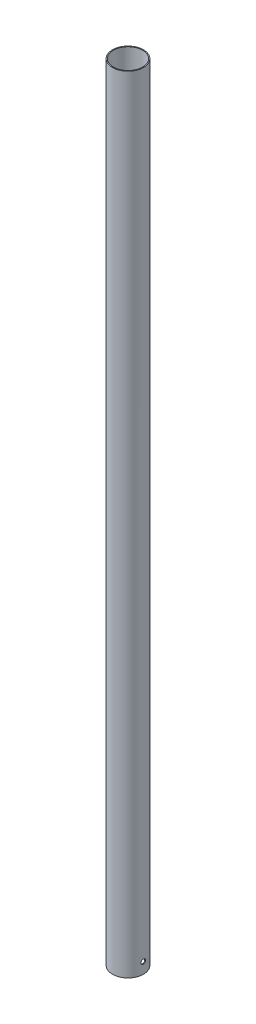
ISO-10303-21;
HEADER;
FILE_DESCRIPTION(('STEP AP214'),'2;1');
FILE_NAME('part.step','',(''),(''),'','','');
FILE_SCHEMA(('AUTOMOTIVE_DESIGN { 1 0 10303 214 1 1 1 1 }'));
ENDSEC;
DATA;
#1=APPLICATION_CONTEXT('core data for automotive mechanical design processes');
#2=APPLICATION_PROTOCOL_DEFINITION('international standard','automotive_design',2000,#1);
#3=PRODUCT_CONTEXT('',#1,'mechanical');
#4=PRODUCT('Part','Part','',(#3));
#5=PRODUCT_RELATED_PRODUCT_CATEGORY('part','',(#4));
#6=PRODUCT_DEFINITION_FORMATION('','',#4);
#7=PRODUCT_DEFINITION_CONTEXT('part definition',#1,'design');
#8=PRODUCT_DEFINITION('design','',#6,#7);
#9=PRODUCT_DEFINITION_SHAPE('','',#8);
#10=(LENGTH_UNIT() NAMED_UNIT(*) SI_UNIT(.MILLI.,.METRE.));
#11=(NAMED_UNIT(*) PLANE_ANGLE_UNIT() SI_UNIT($,.RADIAN.));
#12=(NAMED_UNIT(*) SI_UNIT($,.STERADIAN.) SOLID_ANGLE_UNIT());
#13=UNCERTAINTY_MEASURE_WITH_UNIT(LENGTH_MEASURE(1.E-05),#10,'distance_accuracy_value','');
#14=(GEOMETRIC_REPRESENTATION_CONTEXT(3) GLOBAL_UNCERTAINTY_ASSIGNED_CONTEXT((#13)) GLOBAL_UNIT_ASSIGNED_CONTEXT((#10,
#11,#12)) REPRESENTATION_CONTEXT('',''));
#15=CARTESIAN_POINT('',(0.,0.,0.));
#16=DIRECTION('',(0.,0.,1.));
#17=DIRECTION('',(1.,0.,0.));
#18=AXIS2_PLACEMENT_3D('',#15,#16,#17);
#19=CARTESIAN_POINT('',(0.,3588.,0.));
#20=DIRECTION('',(0.,-1.,0.));
#21=DIRECTION('',(0.,0.,-1.));
#22=AXIS2_PLACEMENT_3D('',#19,#20,#21);
#23=CYLINDRICAL_SURFACE('',#22,70.65);
#24=CARTESIAN_POINT('',(0.,3588.,0.));
#25=DIRECTION('',(0.,1.,0.));
#26=DIRECTION('',(0.,0.,1.));
#27=AXIS2_PLACEMENT_3D('',#24,#25,#26);
#28=CIRCLE('',#27,70.65);
#29=CARTESIAN_POINT('',(0.,3588.,70.65));
#30=VERTEX_POINT('',#29);
#31=EDGE_CURVE('E10',#30,#30,#28,.T.);
#32=ORIENTED_EDGE('',*,*,#31,.F.);
#33=EDGE_LOOP('',(#32));
#34=FACE_BOUND('',#33,.T.);
#35=CARTESIAN_POINT('',(0.,0.,0.));
#36=DIRECTION('',(0.,1.,0.));
#37=DIRECTION('',(0.,0.,1.));
#38=AXIS2_PLACEMENT_3D('',#35,#36,#37);
#39=CIRCLE('',#38,70.65);
#40=CARTESIAN_POINT('',(0.,0.,70.65));
#41=VERTEX_POINT('',#40);
#42=EDGE_CURVE('E35',#41,#41,#39,.T.);
#43=ORIENTED_EDGE('',*,*,#42,.T.);
#44=EDGE_LOOP('',(#43));
#45=FACE_BOUND('',#44,.T.);
#46=CARTESIAN_POINT('',(69.8653884266022,50.,10.5));
#47=CARTESIAN_POINT('',(69.8653868077956,50.2932439508898,10.5000039626959));
#48=CARTESIAN_POINT('',(69.8672383210719,50.5864322616091,10.4877113271215));
#49=CARTESIAN_POINT('',(69.8745874080696,51.1707979675925,10.4386390930965));
#50=CARTESIAN_POINT('',(69.8800857531186,51.4619749242758,10.4018543143992));
#51=CARTESIAN_POINT('',(69.8945776323533,52.040384942187,10.304025900023));
#52=CARTESIAN_POINT('',(69.9035741646534,52.3276144010046,10.242961454489));
#53=CARTESIAN_POINT('',(69.9248012059064,52.8958479324387,10.0970346431254));
#54=CARTESIAN_POINT('',(69.9370317848458,53.176851870189,10.012171762283));
#55=CARTESIAN_POINT('',(69.9643638640576,53.73042722795,9.81935605354532));
#56=CARTESIAN_POINT('',(69.9794630917751,54.0030051256896,9.71142149471269));
#57=CARTESIAN_POINT('',(70.0121077588097,54.5380667749752,9.47321013551929));
#58=CARTESIAN_POINT('',(70.0296532277259,54.800550404333,9.3429330648129));
#59=CARTESIAN_POINT('',(70.066690171728,55.3135701134425,9.06099494400925));
#60=CARTESIAN_POINT('',(70.0861813376226,55.5641080821617,8.90933728993168));
#61=CARTESIAN_POINT('',(70.126564090755,56.0515701396148,8.58569113097046));
#62=CARTESIAN_POINT('',(70.1474556894958,56.288494116495,8.41370245908083));
#63=CARTESIAN_POINT('',(70.1902055786862,56.7487284772624,8.04931158024618));
#64=CARTESIAN_POINT('',(70.2120696334732,56.9719314240115,7.85677433987815));
#65=CARTESIAN_POINT('',(70.2560100192535,57.4013563461544,7.45363384135625));
#66=CARTESIAN_POINT('',(70.2780863513406,57.6075782339958,7.2430304900672));
#67=CARTESIAN_POINT('',(70.3218327204705,58.0016255499886,6.8051991930761));
#68=CARTESIAN_POINT('',(70.3435027306194,58.1894497638745,6.57797015178813));
#69=CARTESIAN_POINT('',(70.3858267509878,58.5453695161554,6.10847236236011));
#70=CARTESIAN_POINT('',(70.4064807849341,58.7134655154036,5.86620396574316));
#71=CARTESIAN_POINT('',(70.4462882946095,59.0294924688663,5.36711450678431));
#72=CARTESIAN_POINT('',(70.4654341930885,59.1773240569005,5.11022990396718));
#73=CARTESIAN_POINT('',(70.5015729495803,59.4508026004135,4.58476350701888));
#74=CARTESIAN_POINT('',(70.5185657986447,59.5764494636908,4.31618166427883));
#75=CARTESIAN_POINT('',(70.5499142495427,59.8046254040933,3.76923341287514));
#76=CARTESIAN_POINT('',(70.5642699575843,59.9071554122625,3.49086739879653));
#77=CARTESIAN_POINT('',(70.5899349079998,60.0883328597191,2.92633204995656));
#78=CARTESIAN_POINT('',(70.6012441746094,60.1669804890003,2.64016277729299));
#79=CARTESIAN_POINT('',(70.6204213257038,60.2993041483902,2.06421793724995));
#80=CARTESIAN_POINT('',(70.6283139563104,60.3531599285273,1.7744844859255));
#81=CARTESIAN_POINT('',(70.6405547827793,60.4363392194099,1.1914428864036));
#82=CARTESIAN_POINT('',(70.6449029942788,60.465662838385,0.898134753982542));
#83=CARTESIAN_POINT('',(70.6499314141251,60.4995519350371,0.310074459882856));
#84=CARTESIAN_POINT('',(70.6506117992507,60.5041186059284,0.0153223684843043));
#85=CARTESIAN_POINT('',(70.6482856825474,60.4884617397955,-0.5735073094622));
#86=CARTESIAN_POINT('',(70.6452791963514,60.468238307885,-0.867584898864843));
#87=CARTESIAN_POINT('',(70.6357028669341,60.403414547276,-1.45062830723286));
#88=CARTESIAN_POINT('',(70.6291613416513,60.3590079199348,-1.73961615318771));
#89=CARTESIAN_POINT('',(70.6127163130375,60.246282745864,-2.31279011691312));
#90=CARTESIAN_POINT('',(70.602812830295,60.1779643455681,-2.5969762640777));
#91=CARTESIAN_POINT('',(70.5799192860665,60.0179225574663,-3.15855604841208));
#92=CARTESIAN_POINT('',(70.5669291713864,59.9261987662958,-3.43594956842857));
#93=CARTESIAN_POINT('',(70.538222684041,59.7200191939862,-3.98200971004599));
#94=CARTESIAN_POINT('',(70.5225062960156,59.6055632847712,-4.25067628246815));
#95=CARTESIAN_POINT('',(70.4887189247937,59.3542794999805,-4.77840798728216));
#96=CARTESIAN_POINT('',(70.4706394218891,59.2173701951567,-5.03743379788062));
#97=CARTESIAN_POINT('',(70.4326729917789,58.9224602655523,-5.5430459103717));
#98=CARTESIAN_POINT('',(70.4127860618048,58.7644596084675,-5.78963219321064));
#99=CARTESIAN_POINT('',(70.3717540951022,58.4284676314029,-6.26869492645658));
#100=CARTESIAN_POINT('',(70.3506089898059,58.2504752214481,-6.50117060647057));
#101=CARTESIAN_POINT('',(70.3076463299507,57.8757391386993,-6.95041704743086));
#102=CARTESIAN_POINT('',(70.2858287709031,57.6789953407169,-7.16718770350993));
#103=CARTESIAN_POINT('',(70.2419136566546,57.2661174201934,-7.58556161733868));
#104=CARTESIAN_POINT('',(70.2198154332787,57.0498142727342,-7.78699803848535));
#105=CARTESIAN_POINT('',(70.1761739862606,56.6009675763107,-8.17095154502307));
#106=CARTESIAN_POINT('',(70.1546307664002,56.3684239167235,-8.35346850152233));
#107=CARTESIAN_POINT('',(70.1127112743725,55.8887063720788,-8.69829847681125));
#108=CARTESIAN_POINT('',(70.0923350134992,55.6415323454721,-8.86061130007806));
#109=CARTESIAN_POINT('',(70.0533321804341,55.1342754308124,-9.16387112712552));
#110=CARTESIAN_POINT('',(70.0347056037548,54.8741925758695,-9.30481818570392));
#111=CARTESIAN_POINT('',(69.9997249373533,54.3427340808488,-9.56442300344919));
#112=CARTESIAN_POINT('',(69.9833725997311,54.0713499409921,-9.68306360195102));
#113=CARTESIAN_POINT('',(69.9534324832596,53.5193955318163,-9.89704322020492));
#114=CARTESIAN_POINT('',(69.939844708857,53.2388252477225,-9.99238220247746));
#115=CARTESIAN_POINT('',(69.9158322560455,52.6705215277148,-10.1590351344735));
#116=CARTESIAN_POINT('',(69.9054073986575,52.3827884981145,-10.2303504436431));
#117=CARTESIAN_POINT('',(69.8880270838446,51.8022233789266,-10.3484171479562));
#118=CARTESIAN_POINT('',(69.8810715967544,51.509391332961,-10.3951687531348));
#119=CARTESIAN_POINT('',(69.8708846063526,50.9235637504533,-10.4634203049617));
#120=CARTESIAN_POINT('',(69.8676182766578,50.6305963169164,-10.4851564403739));
#121=CARTESIAN_POINT('',(69.8647862768676,50.0438533162234,-10.504010234184));
#122=CARTESIAN_POINT('',(69.8652205834234,49.7500777541779,-10.5011280479088));
#123=CARTESIAN_POINT('',(69.8697771027464,49.1638382924398,-10.4707679475952));
#124=CARTESIAN_POINT('',(69.8738992087805,48.8713743550321,-10.4432907453913));
#125=CARTESIAN_POINT('',(69.8857110727229,48.2898466759379,-10.363951598682));
#126=CARTESIAN_POINT('',(69.8934008274483,48.000782931218,-10.3120896759322));
#127=CARTESIAN_POINT('',(69.9120785516072,47.4295271118311,-10.1846889920712));
#128=CARTESIAN_POINT('',(69.923050107419,47.1473082254249,-10.1092679782885));
#129=CARTESIAN_POINT('',(69.9479909195116,46.590254712591,-9.93522957202909));
#130=CARTESIAN_POINT('',(69.9619601627301,46.3154200539925,-9.83661228062961));
#131=CARTESIAN_POINT('',(69.9925001161996,45.7750318215374,-9.61689764604026));
#132=CARTESIAN_POINT('',(70.0090708928266,45.5094784846972,-9.49579972926177));
#133=CARTESIAN_POINT('',(70.0443471257812,44.9894742740669,-9.23198981782507));
#134=CARTESIAN_POINT('',(70.0630526491988,44.7350237495598,-9.08927714381935));
#135=CARTESIAN_POINT('',(70.1022189811833,44.237130826133,-8.7821142379209));
#136=CARTESIAN_POINT('',(70.1226917300971,43.9937835768604,-8.6175112875572));
#137=CARTESIAN_POINT('',(70.1646951611419,43.5217892928642,-8.26855039742001));
#138=CARTESIAN_POINT('',(70.1862258478095,43.2931423211888,-8.08419237292801));
#139=CARTESIAN_POINT('',(70.2297429988655,42.8521001219638,-7.69698923813225));
#140=CARTESIAN_POINT('',(70.2517294907204,42.6397058774325,-7.49414301122459));
#141=CARTESIAN_POINT('',(70.2955427949651,42.2326456953528,-7.07137287605494));
#142=CARTESIAN_POINT('',(70.3173696103329,42.0379794263985,-6.85144928717877));
#143=CARTESIAN_POINT('',(70.3604320855007,41.6661961871102,-6.39415803453531));
#144=CARTESIAN_POINT('',(70.3816614341905,41.4892361229515,-6.15666217535102));
#145=CARTESIAN_POINT('',(70.4227398463575,41.1559541698472,-5.66749022669614));
#146=CARTESIAN_POINT('',(70.4425889011978,40.9996324100352,-5.41581404851358));
#147=CARTESIAN_POINT('',(70.4803439747844,40.7087572109394,-4.90004702762652));
#148=CARTESIAN_POINT('',(70.4982500294794,40.5742033688903,-4.63595641473929));
#149=CARTESIAN_POINT('',(70.5316108236673,40.3278477292655,-4.09721870903808));
#150=CARTESIAN_POINT('',(70.5470655775195,40.2160457984103,-3.8225716780743));
#151=CARTESIAN_POINT('',(70.5750324197792,40.0163912957741,-3.2656903041152));
#152=CARTESIAN_POINT('',(70.58755500836,39.9284530816428,-2.98348719635895));
#153=CARTESIAN_POINT('',(70.6093738976419,39.7766526716166,-2.41255464128633));
#154=CARTESIAN_POINT('',(70.6186702031722,39.7127904396834,-2.1238252037396));
#155=CARTESIAN_POINT('',(70.6337711766946,39.6096324355602,-1.5419358700558));
#156=CARTESIAN_POINT('',(70.6395760344149,39.570335328476,-1.24877621554809));
#157=CARTESIAN_POINT('',(70.6475289845613,39.5166054825114,-0.660138491001243));
#158=CARTESIAN_POINT('',(70.6496771028478,39.5021725677924,-0.364660437372586));
#159=CARTESIAN_POINT('',(70.6502525264476,39.4983009306492,0.22361153200235));
#160=CARTESIAN_POINT('',(70.6487155006485,39.5086226063006,0.516403864283397));
#161=CARTESIAN_POINT('',(70.6420380655269,39.553683077044,1.10006039523698));
#162=CARTESIAN_POINT('',(70.6368976809919,39.5884217041717,1.39092460715917));
#163=CARTESIAN_POINT('',(70.6231576735045,39.6820525236096,1.96865293458877));
#164=CARTESIAN_POINT('',(70.6145580731873,39.7409445578736,2.25551707625766));
#165=CARTESIAN_POINT('',(70.5941401054888,39.8824403818106,2.82321885738941));
#166=CARTESIAN_POINT('',(70.5823217298451,39.9650442323491,3.1040564813809));
#167=CARTESIAN_POINT('',(70.5558051466218,40.1532843536874,3.65753666148297));
#168=CARTESIAN_POINT('',(70.5411090064238,40.2589040960157,3.93018493957605));
#169=CARTESIAN_POINT('',(70.5092390917966,40.4924414411683,4.46560575404623));
#170=CARTESIAN_POINT('',(70.492065320941,40.6203590118318,4.72837830466671));
#171=CARTESIAN_POINT('',(70.4557183401323,40.8975491465402,5.24219244936003));
#172=CARTESIAN_POINT('',(70.436545533964,41.0468174002213,5.49323639771306));
#173=CARTESIAN_POINT('',(70.3967168077883,41.3657501033865,5.9820508842366));
#174=CARTESIAN_POINT('',(70.3760602241082,41.5354237030608,6.21981539711785));
#175=CARTESIAN_POINT('',(70.3336459501417,41.8955867650156,6.68245545165204));
#176=CARTESIAN_POINT('',(70.3118798883895,42.0862531183408,6.9071925378498));
#177=CARTESIAN_POINT('',(70.26804337252,42.4856937297401,7.33974313112421));
#178=CARTESIAN_POINT('',(70.2459730500361,42.6944603517461,7.54756370381724));
#179=CARTESIAN_POINT('',(70.2021283342876,43.1288269671279,7.94504155074765));
#180=CARTESIAN_POINT('',(70.1803540795024,43.3544345376195,8.13469056049514));
#181=CARTESIAN_POINT('',(70.1377258108324,43.8208415234673,8.49439407729127));
#182=CARTESIAN_POINT('',(70.1168717862778,44.0616407626007,8.66444881156819));
#183=CARTESIAN_POINT('',(70.0765633231744,44.5581461690661,8.98465182125736));
#184=CARTESIAN_POINT('',(70.0571172782493,44.813927529319,9.13468459732241));
#185=CARTESIAN_POINT('',(70.0203143966526,45.3373738450066,9.41263691767094));
#186=CARTESIAN_POINT('',(70.0029575292949,45.6050386258165,9.54055678676447));
#187=CARTESIAN_POINT('',(69.9708520648531,46.1501222355337,9.77323692857143));
#188=CARTESIAN_POINT('',(69.9561010927739,46.4275319036244,9.87801831155085));
#189=CARTESIAN_POINT('',(69.9296219096159,46.9902572313866,10.0637594456414));
#190=CARTESIAN_POINT('',(69.9178930188594,47.2755710973585,10.1447245537057));
#191=CARTESIAN_POINT('',(69.8939673343612,47.9622630707961,10.3085027401896));
#192=CARTESIAN_POINT('',(69.8832994701823,48.3663898458444,10.3802342520631));
#193=CARTESIAN_POINT('',(69.8690111916866,49.1803806746395,10.4759798128389));
#194=CARTESIAN_POINT('',(69.8653906885915,49.590244656047,10.4999944628497));
#195=CARTESIAN_POINT('',(69.8653884266022,50.,10.5));
#196=B_SPLINE_CURVE_WITH_KNOTS('',3,(#46,#47,#48,#49,#50,#51,#52,#53,#54,#55,#56,#57,#58,#59,
#60,#61,#62,#63,#64,#65,#66,#67,#68,#69,#70,#71,#72,#73,#74,#75,#76,#77,#78,#79,#80,#81,#82,#83,
#84,#85,#86,#87,#88,#89,#90,#91,#92,#93,#94,#95,#96,#97,#98,#99,#100,#101,#102,#103,#104,#105,
#106,#107,#108,#109,#110,#111,#112,#113,#114,#115,#116,#117,#118,#119,#120,#121,#122,#123,#124,
#125,#126,#127,#128,#129,#130,#131,#132,#133,#134,#135,#136,#137,#138,#139,#140,#141,#142,#143,
#144,#145,#146,#147,#148,#149,#150,#151,#152,#153,#154,#155,#156,#157,#158,#159,#160,#161,#162,
#163,#164,#165,#166,#167,#168,#169,#170,#171,#172,#173,#174,#175,#176,#177,#178,#179,#180,#181,
#182,#183,#184,#185,#186,#187,#188,#189,#190,#191,#192,#193,#194,#195),.UNSPECIFIED.,.T.,.F.,(4,
2,2,2,2,2,2,2,2,2,2,2,2,2,2,2,2,2,2,2,2,2,2,2,2,2,2,2,2,2,2,2,2,2,2,2,2,2,2,2,2,2,2,2,2,2,2,2,2,
2,2,2,2,2,2,2,2,2,2,2,2,2,2,2,2,2,2,2,2,2,2,2,2,2,4),(0.,0.879372845288269,1.7589317427325,
2.63924613182132,3.51957957292258,4.39921849668794,5.27886806488317,6.15837806959949,
7.03789529941568,7.92359681132245,8.80930288950944,9.69506738587756,10.5808111865752,
11.4707537040756,12.3606999201609,13.2506102867653,14.1405135735878,15.0238589743542,
15.9072004780019,16.7904994067248,17.6737945901438,18.5501166870823,19.4264334175933,
20.3027652514205,21.1791020227654,22.0586901922766,22.9382797090156,23.8179172053642,
24.6975605747788,25.5857054551018,26.4738563856523,27.3620159104991,28.2501731574045,
29.1390109048327,30.0278500819047,30.916638953099,31.8054202244663,32.6857392003039,
33.5660526218603,34.4463405660137,35.3266277247929,36.2025838018421,37.0785360620062,
37.954510674988,38.8305128253922,39.7129829085221,40.5954567762258,41.4779839767262,
42.3604946759178,43.2502382426293,44.1399873761887,45.0297200451048,45.9194475018595,
46.8059383498896,47.6924278709695,48.57886921511,49.4653042903468,50.3431941617397,
51.2210779941846,52.098956082348,52.9768364239432,53.8540883961845,54.7313391031505,
55.6084129564419,56.4858815851145,57.3714103446127,58.2565673218992,59.1421249795781,
60.0276723667058,60.9181256178083,61.8085657881906,62.6981901830205,63.5876143229098,
64.816394186465,66.0451585704896),.UNSPECIFIED.);
#197=CARTESIAN_POINT('',(69.8653884266022,50.,10.5));
#198=VERTEX_POINT('',#197);
#199=EDGE_CURVE('E50',#198,#198,#196,.T.);
#200=ORIENTED_EDGE('',*,*,#199,.T.);
#201=EDGE_LOOP('',(#200));
#202=FACE_BOUND('',#201,.T.);
#203=ADVANCED_FACE('F32',(#34,#45,#202),#23,.T.);
#204=CARTESIAN_POINT('',(0.,3588.,0.));
#205=DIRECTION('',(0.,-1.,0.));
#206=DIRECTION('',(0.,0.,-1.));
#207=AXIS2_PLACEMENT_3D('',#204,#205,#206);
#208=CYLINDRICAL_SURFACE('',#207,66.69);
#209=CARTESIAN_POINT('',(0.,0.,0.));
#210=DIRECTION('',(0.,1.,0.));
#211=DIRECTION('',(0.,0.,1.));
#212=AXIS2_PLACEMENT_3D('',#209,#210,#211);
#213=CIRCLE('',#212,66.69);
#214=CARTESIAN_POINT('',(0.,0.,66.69));
#215=VERTEX_POINT('',#214);
#216=EDGE_CURVE('E44',#215,#215,#213,.T.);
#217=ORIENTED_EDGE('',*,*,#216,.F.);
#218=EDGE_LOOP('',(#217));
#219=FACE_BOUND('',#218,.T.);
#220=CARTESIAN_POINT('',(0.,3588.,0.));
#221=DIRECTION('',(0.,1.,0.));
#222=DIRECTION('',(0.,0.,1.));
#223=AXIS2_PLACEMENT_3D('',#220,#221,#222);
#224=CIRCLE('',#223,66.69);
#225=CARTESIAN_POINT('',(0.,3588.,66.69));
#226=VERTEX_POINT('',#225);
#227=EDGE_CURVE('E42',#226,#226,#224,.T.);
#228=ORIENTED_EDGE('',*,*,#227,.T.);
#229=EDGE_LOOP('',(#228));
#230=FACE_BOUND('',#229,.T.);
#231=CARTESIAN_POINT('',(65.8582272764763,50.,10.5));
#232=CARTESIAN_POINT('',(65.8582254518199,50.2930283477437,10.5000042223557));
#233=CARTESIAN_POINT('',(65.8601868097875,50.5859984751915,10.4877295176605));
#234=CARTESIAN_POINT('',(65.8679714235622,51.1699262139506,10.4387304905113));
#235=CARTESIAN_POINT('',(65.8737954717838,51.4608833999379,10.4020011512872));
#236=CARTESIAN_POINT('',(65.8891450628474,52.0388449384347,10.3043240089796));
#237=CARTESIAN_POINT('',(65.8986736878418,52.3258457929178,10.2433560387623));
#238=CARTESIAN_POINT('',(65.9211550879539,52.8936233811088,10.0976651141013));
#239=CARTESIAN_POINT('',(65.9341079389804,53.1743999766867,10.012941633039));
#240=CARTESIAN_POINT('',(65.9630521658937,53.7275159719729,9.82045334340441));
#241=CARTESIAN_POINT('',(65.9790410260955,53.9998621414878,9.71270760224277));
#242=CARTESIAN_POINT('',(66.0136075175552,54.5344726050366,9.47492201775696));
#243=CARTESIAN_POINT('',(66.0321851789651,54.7967367815987,9.34488191476351));
#244=CARTESIAN_POINT('',(66.0714000069353,55.3093415339004,9.0634635047113));
#245=CARTESIAN_POINT('',(66.0920368702638,55.5596838572186,8.91208833803873));
#246=CARTESIAN_POINT('',(66.1347929394573,56.0467850941021,8.58905101007403));
#247=CARTESIAN_POINT('',(66.1569121589692,56.2835438825767,8.41738866200195));
#248=CARTESIAN_POINT('',(66.2021941147494,56.7436821070213,8.05353688287419));
#249=CARTESIAN_POINT('',(66.2253637019447,56.9669413754939,7.86119631934286));
#250=CARTESIAN_POINT('',(66.2719299432858,57.3964991353893,7.45845043540749));
#251=CARTESIAN_POINT('',(66.2953265987149,57.6027975308824,7.24804501284344));
#252=CARTESIAN_POINT('',(66.3416923309932,57.9970226713694,6.81060391433789));
#253=CARTESIAN_POINT('',(66.3646613785563,58.1849481617591,6.58356710456195));
#254=CARTESIAN_POINT('',(66.4095265571029,58.5410968569047,6.11444132328535));
#255=CARTESIAN_POINT('',(66.4314227134279,58.7093205271438,5.87235270761182));
#256=CARTESIAN_POINT('',(66.473641907134,59.0257239501487,5.37345539326318));
#257=CARTESIAN_POINT('',(66.4939559265791,59.173791954811,5.11657503899699));
#258=CARTESIAN_POINT('',(66.5323041692981,59.4477406108955,4.59107786499226));
#259=CARTESIAN_POINT('',(66.5503383819176,59.5736211586288,4.32246099041263));
#260=CARTESIAN_POINT('',(66.5836129030693,59.8022552003168,3.77540387160546));
#261=CARTESIAN_POINT('',(66.5988533374695,59.9050097362133,3.49696407060369));
#262=CARTESIAN_POINT('',(66.6261056437527,60.0866209013304,2.93224306963232));
#263=CARTESIAN_POINT('',(66.6381175445214,60.1654777443637,2.64596193984407));
#264=CARTESIAN_POINT('',(66.6584838712305,60.2981375086449,2.07001693663804));
#265=CARTESIAN_POINT('',(66.6668676689968,60.3521418620489,1.78040049153291));
#266=CARTESIAN_POINT('',(66.6798836346902,60.435635394004,1.19757142786944));
#267=CARTESIAN_POINT('',(66.6845158211662,60.4651246937624,0.904358827098476));
#268=CARTESIAN_POINT('',(66.6898969046881,60.4993588430156,0.316472871536749));
#269=CARTESIAN_POINT('',(66.6906460103934,60.5041050220957,0.0217995960879007));
#270=CARTESIAN_POINT('',(66.6882401747039,60.4888194996843,-0.566886766048772));
#271=CARTESIAN_POINT('',(66.6850852519266,60.4687879163529,-0.860899855878187));
#272=CARTESIAN_POINT('',(66.6750060343534,60.4043898017906,-1.44354339762935));
#273=CARTESIAN_POINT('',(66.6681153713146,60.3602403697364,-1.73219845924366));
#274=CARTESIAN_POINT('',(66.6507791763801,60.2480890972366,-2.30472568925086));
#275=CARTESIAN_POINT('',(66.6403336689169,60.1800874207281,-2.58859789050241));
#276=CARTESIAN_POINT('',(66.6161775543393,60.020738883012,-3.14957400013086));
#277=CARTESIAN_POINT('',(66.6024668858548,59.9293915830108,-3.42667778118437));
#278=CARTESIAN_POINT('',(66.5721597120398,59.7240246464474,-3.97218905852089));
#279=CARTESIAN_POINT('',(66.5555631886047,59.6100048676476,-4.24059650023441));
#280=CARTESIAN_POINT('',(66.5198679332204,59.3596015713438,-4.76795682392175));
#281=CARTESIAN_POINT('',(66.5007591660201,59.2231277793922,-5.02686615824616));
#282=CARTESIAN_POINT('',(66.4606215199406,58.9291270093807,-5.53228371679007));
#283=CARTESIAN_POINT('',(66.4395926378198,58.7715999957782,-5.77879192007282));
#284=CARTESIAN_POINT('',(66.3961936698756,58.4365877029173,-6.25774728880868));
#285=CARTESIAN_POINT('',(66.3738235022438,58.2591012056994,-6.49019359485003));
#286=CARTESIAN_POINT('',(66.3283596527432,57.8854029394114,-6.9394372976401));
#287=CARTESIAN_POINT('',(66.3052659654317,57.6891910294544,-7.15623457662654));
#288=CARTESIAN_POINT('',(66.2587411039458,57.2771570517177,-7.57497158950235));
#289=CARTESIAN_POINT('',(66.2353089854604,57.0611454273367,-7.77672474368653));
#290=CARTESIAN_POINT('',(66.1890187218607,56.6128506504312,-8.16133759981065));
#291=CARTESIAN_POINT('',(66.1661605811283,56.380567373738,-8.34419715754764));
#292=CARTESIAN_POINT('',(66.1216674813483,55.9013320409507,-8.68973799459911));
#293=CARTESIAN_POINT('',(66.1000325363859,55.6543798160105,-8.85241904158359));
#294=CARTESIAN_POINT('',(66.0586050068096,55.1475217421643,-9.15643774410678));
#295=CARTESIAN_POINT('',(66.038812417014,54.8876159296945,-9.29777545967609));
#296=CARTESIAN_POINT('',(66.0016228706608,54.3564173348948,-9.55820102198686));
#297=CARTESIAN_POINT('',(65.984228165025,54.0851141611906,-9.67726799983274));
#298=CARTESIAN_POINT('',(65.9523630870566,53.5332656676756,-9.89210319045138));
#299=CARTESIAN_POINT('',(65.9378927201409,53.2527203307462,-9.98787136006682));
#300=CARTESIAN_POINT('',(65.912302421813,52.6844135714607,-10.1553766657035));
#301=CARTESIAN_POINT('',(65.9011822763255,52.396652611448,-10.2271153372155));
#302=CARTESIAN_POINT('',(65.8826205262651,51.8159809008985,-10.3460156566488));
#303=CARTESIAN_POINT('',(65.8751788861814,51.5230702001034,-10.3931775418243));
#304=CARTESIAN_POINT('',(65.8642541498031,50.9373822992594,-10.462185880584));
#305=CARTESIAN_POINT('',(65.8607296417221,50.6446370566943,-10.4842972170606));
#306=CARTESIAN_POINT('',(65.857600612247,50.05830311938,-10.5039346071994));
#307=CARTESIAN_POINT('',(65.8579960631206,49.7647144306126,-10.5014608347922));
#308=CARTESIAN_POINT('',(65.8626952786754,49.1788161847821,-10.4719478638298));
#309=CARTESIAN_POINT('',(65.8669989161401,48.8865065863942,-10.4449094648847));
#310=CARTESIAN_POINT('',(65.8793885113264,48.3052554989577,-10.3664768372033));
#311=CARTESIAN_POINT('',(65.8874744650793,48.0163140063754,-10.3150826340229));
#312=CARTESIAN_POINT('',(65.9071380095273,47.445461695194,-10.1886858703347));
#313=CARTESIAN_POINT('',(65.9186958381636,47.1635206134043,-10.1138168266839));
#314=CARTESIAN_POINT('',(65.9449878568437,46.606978795465,-9.94094127171015));
#315=CARTESIAN_POINT('',(65.9597220312197,46.3323780231156,-9.84293487451573));
#316=CARTESIAN_POINT('',(65.9919488187164,45.7924051761571,-9.62449845250466));
#317=CARTESIAN_POINT('',(66.0094415131108,45.527033373741,-9.50406776698576));
#318=CARTESIAN_POINT('',(66.0466929289604,45.0073317416952,-9.24164524245518));
#319=CARTESIAN_POINT('',(66.0664517243736,44.7530022728247,-9.09965269968614));
#320=CARTESIAN_POINT('',(66.1078535279809,44.2550655372459,-8.79384982191984));
#321=CARTESIAN_POINT('',(66.1295107434726,44.0115641096278,-8.6298690623231));
#322=CARTESIAN_POINT('',(66.1739575545888,43.5392060469179,-8.28215850106686));
#323=CARTESIAN_POINT('',(66.1967471556191,43.3103494817521,-8.09842860512059));
#324=CARTESIAN_POINT('',(66.2428225160249,42.8688251221527,-7.71247855958692));
#325=CARTESIAN_POINT('',(66.2661083083799,42.656158408105,-7.51025717799865));
#326=CARTESIAN_POINT('',(66.3125254593411,42.2484869519255,-7.08872457736879));
#327=CARTESIAN_POINT('',(66.3356568207651,42.0534818867107,-6.8694136710808));
#328=CARTESIAN_POINT('',(66.3813334512027,41.6807531462371,-6.4130897585049));
#329=CARTESIAN_POINT('',(66.4038713203719,41.5032059947886,-6.17593178183599));
#330=CARTESIAN_POINT('',(66.447498386486,41.168723339732,-5.68737159505513));
#331=CARTESIAN_POINT('',(66.46858757322,41.0117879813958,-5.43596928456704));
#332=CARTESIAN_POINT('',(66.508719523739,40.719665205842,-4.92068062504536));
#333=CARTESIAN_POINT('',(66.5277623287914,40.5844773500364,-4.65679452791476));
#334=CARTESIAN_POINT('',(66.5632610222024,40.3368409183998,-4.1183922727018));
#335=CARTESIAN_POINT('',(66.5797169274596,40.224392194027,-3.84387618407308));
#336=CARTESIAN_POINT('',(66.6095129727863,40.0234797808463,-3.28728360169214));
#337=CARTESIAN_POINT('',(66.6228653249352,39.9349218558193,-3.00524178208129));
#338=CARTESIAN_POINT('',(66.6461592908898,39.7818702604849,-2.43456317276631));
#339=CARTESIAN_POINT('',(66.6561009102312,39.7173765511206,-2.14592639376683));
#340=CARTESIAN_POINT('',(66.6722894349171,39.612953107906,-1.56415824084761));
#341=CARTESIAN_POINT('',(66.6785365666634,39.573021868838,-1.27102714347367));
#342=CARTESIAN_POINT('',(66.6871583443078,39.518028394598,-0.682385489296795));
#343=CARTESIAN_POINT('',(66.6895330211357,39.5029659607953,-0.386874951517728));
#344=CARTESIAN_POINT('',(66.6903377352012,39.4978549353865,0.201167797576085));
#345=CARTESIAN_POINT('',(66.6888101618737,39.5075375433667,0.493697650148059));
#346=CARTESIAN_POINT('',(66.6819425472159,39.5512762870505,1.07688243723618));
#347=CARTESIAN_POINT('',(66.6766025353063,39.5853322346632,1.36753738620364));
#348=CARTESIAN_POINT('',(66.6622595943233,39.6775572141977,1.9449006871727));
#349=CARTESIAN_POINT('',(66.653256694566,39.7357260531306,2.23160907074191));
#350=CARTESIAN_POINT('',(66.6318393181236,39.8757374836574,2.79905498962613));
#351=CARTESIAN_POINT('',(66.6194248318732,39.9575801416278,3.07979250819767));
#352=CARTESIAN_POINT('',(66.5915421990526,40.1442456372392,3.63308040378975));
#353=CARTESIAN_POINT('',(66.576076808684,40.24904774258,3.90563791647448));
#354=CARTESIAN_POINT('',(66.5425130281742,40.480909181354,4.44094460852106));
#355=CARTESIAN_POINT('',(66.5244146425246,40.6079684768185,4.70369380461402));
#356=CARTESIAN_POINT('',(66.4860870556386,40.8834075366127,5.21753787935663));
#357=CARTESIAN_POINT('',(66.4658582702737,41.0317831418762,5.46863501884674));
#358=CARTESIAN_POINT('',(66.4238127444678,41.3489018203377,5.95763898529757));
#359=CARTESIAN_POINT('',(66.4019952930628,41.5176540350435,6.1955398216639));
#360=CARTESIAN_POINT('',(66.3571492354099,41.8761405282843,6.65879601977736));
#361=CARTESIAN_POINT('',(66.3341104917636,42.0660724935514,6.88399744768575));
#362=CARTESIAN_POINT('',(66.2876852887539,42.4640756628026,7.31754063625975));
#363=CARTESIAN_POINT('',(66.2642989789467,42.6721392421418,7.52588941335276));
#364=CARTESIAN_POINT('',(66.217813747338,43.1051397662941,7.92448946915099));
#365=CARTESIAN_POINT('',(66.1947149600035,43.3300842839906,8.11473253768052));
#366=CARTESIAN_POINT('',(66.1494661577343,43.7952166623012,8.4756901295223));
#367=CARTESIAN_POINT('',(66.1273161323999,44.0354043557588,8.64640486692442));
#368=CARTESIAN_POINT('',(66.0844578558423,44.5309267975421,8.9681124432796));
#369=CARTESIAN_POINT('',(66.0637595177998,44.7863470928955,9.11897488316543));
#370=CARTESIAN_POINT('',(66.0245570280892,45.3091605975722,9.39861221910851));
#371=CARTESIAN_POINT('',(66.0060528433252,45.5765536262191,9.52738744833469));
#372=CARTESIAN_POINT('',(65.9717930516454,46.1211932338945,9.76179586511975));
#373=CARTESIAN_POINT('',(65.9560349937802,46.3984307577576,9.86744971054457));
#374=CARTESIAN_POINT('',(65.9277122934361,46.9609067386199,10.0549397420467));
#375=CARTESIAN_POINT('',(65.9151469478657,47.2461434186741,10.1367811726149));
#376=CARTESIAN_POINT('',(65.8892900374967,47.9374100193771,10.303759058913));
#377=CARTESIAN_POINT('',(65.8776965579288,48.3463705796612,10.377264799325));
#378=CARTESIAN_POINT('',(65.8621665266892,49.1702597099056,10.4753819123413));
#379=CARTESIAN_POINT('',(65.8582298594652,49.5851881897062,10.4999940228205));
#380=CARTESIAN_POINT('',(65.8582272764763,50.,10.5));
#381=B_SPLINE_CURVE_WITH_KNOTS('',3,(#231,#232,#233,#234,#235,#236,#237,#238,#239,#240,#241,
#242,#243,#244,#245,#246,#247,#248,#249,#250,#251,#252,#253,#254,#255,#256,#257,#258,#259,#260,
#261,#262,#263,#264,#265,#266,#267,#268,#269,#270,#271,#272,#273,#274,#275,#276,#277,#278,#279,
#280,#281,#282,#283,#284,#285,#286,#287,#288,#289,#290,#291,#292,#293,#294,#295,#296,#297,#298,
#299,#300,#301,#302,#303,#304,#305,#306,#307,#308,#309,#310,#311,#312,#313,#314,#315,#316,#317,
#318,#319,#320,#321,#322,#323,#324,#325,#326,#327,#328,#329,#330,#331,#332,#333,#334,#335,#336,
#337,#338,#339,#340,#341,#342,#343,#344,#345,#346,#347,#348,#349,#350,#351,#352,#353,#354,#355,
#356,#357,#358,#359,#360,#361,#362,#363,#364,#365,#366,#367,#368,#369,#370,#371,#372,#373,#374,
#375,#376,#377,#378,#379,#380),.UNSPECIFIED.,.T.,.F.,(4,2,2,2,2,2,2,2,2,2,2,2,2,2,2,2,2,2,2,2,2,
2,2,2,2,2,2,2,2,2,2,2,2,2,2,2,2,2,2,2,2,2,2,2,2,2,2,2,2,2,2,2,2,2,2,2,2,2,2,2,2,2,2,2,2,2,2,2,2,
2,2,2,2,2,4),(0.,0.878721440473774,1.75762320268936,2.63725776822698,3.51691183528231,
4.3958401630443,5.27477872865037,6.15358805491982,7.03240547283841,7.91814986227681,
8.80389926108787,9.68970910160974,10.5754980093995,11.4660136467976,12.3565334457422,
13.2470131143084,14.1374848155197,15.020606207704,15.9037232335351,16.7867928040924,
17.6698581634889,18.5451024584772,19.4203407380084,20.2955954693276,21.1708556918029,
22.0497248977454,22.9285955874284,23.8075199363229,24.6864508986213,25.5749116755561,
26.4633792330528,27.351857019179,28.2403323063115,29.1296360173972,30.0189413757633,
30.9081898964573,31.7974298325548,32.677176582798,33.5569171091593,34.4366289998639,
35.3163399675099,36.1911355273766,37.0659267722743,37.9407437958287,38.8155893786711,
39.69765657864,40.5797279899816,41.461858212479,42.3439722949937,43.2342453344863,
44.124524648283,45.014786005313,45.9050415465854,46.7917323921961,47.6784217986714,
48.5650568623344,49.4516848442827,50.3287225987106,51.2057535850472,52.0827775521511,
52.9598039782793,53.8360416932193,54.7122779133967,55.5883434010412,56.4648033863074,
57.3502646017089,58.2353552463366,59.120845348825,60.006325742719,60.8973593733676,
61.7883795622628,62.6786003867222,63.5686249986068,64.8125644853035,66.0564851990281),.UNSPECIFIED.);
#382=CARTESIAN_POINT('',(65.8582272764763,50.,10.5));
#383=VERTEX_POINT('',#382);
#384=EDGE_CURVE('E47',#383,#383,#381,.T.);
#385=ORIENTED_EDGE('',*,*,#384,.F.);
#386=EDGE_LOOP('',(#385));
#387=FACE_BOUND('',#386,.T.);
#388=ADVANCED_FACE('F70',(#219,#230,#387),#208,.F.);
#389=CARTESIAN_POINT('',(0.,3588.,0.));
#390=DIRECTION('',(0.,1.,0.));
#391=DIRECTION('',(0.,0.,1.));
#392=AXIS2_PLACEMENT_3D('',#389,#390,#391);
#393=PLANE('',#392);
#394=ORIENTED_EDGE('',*,*,#31,.T.);
#395=EDGE_LOOP('',(#394));
#396=FACE_BOUND('',#395,.T.);
#397=ORIENTED_EDGE('',*,*,#227,.F.);
#398=EDGE_LOOP('',(#397));
#399=FACE_BOUND('',#398,.T.);
#400=ADVANCED_FACE('F74',(#396,#399),#393,.T.);
#401=CARTESIAN_POINT('',(0.,0.,0.));
#402=DIRECTION('',(0.,1.,0.));
#403=DIRECTION('',(0.,0.,1.));
#404=AXIS2_PLACEMENT_3D('',#401,#402,#403);
#405=PLANE('',#404);
#406=ORIENTED_EDGE('',*,*,#42,.F.);
#407=EDGE_LOOP('',(#406));
#408=FACE_BOUND('',#407,.T.);
#409=ORIENTED_EDGE('',*,*,#216,.T.);
#410=EDGE_LOOP('',(#409));
#411=FACE_BOUND('',#410,.T.);
#412=ADVANCED_FACE('F68',(#408,#411),#405,.F.);
#413=CARTESIAN_POINT('',(70.651,50.,0.));
#414=DIRECTION('',(-1.,0.,0.));
#415=DIRECTION('',(0.,0.,1.));
#416=AXIS2_PLACEMENT_3D('',#413,#414,#415);
#417=CYLINDRICAL_SURFACE('',#416,10.5);
#418=ORIENTED_EDGE('',*,*,#384,.T.);
#419=EDGE_LOOP('',(#418));
#420=FACE_BOUND('',#419,.T.);
#421=ORIENTED_EDGE('',*,*,#199,.F.);
#422=EDGE_LOOP('',(#421));
#423=FACE_BOUND('',#422,.T.);
#424=ADVANCED_FACE('F62',(#420,#423),#417,.F.);
#425=CLOSED_SHELL('',(#203,#388,#400,#412,#424));
#426=MANIFOLD_SOLID_BREP('B2',#425);
#427=ADVANCED_BREP_SHAPE_REPRESENTATION('',(#18,#426),#14);
#428=SHAPE_DEFINITION_REPRESENTATION(#9,#427);
ENDSEC;
END-ISO-10303-21;
